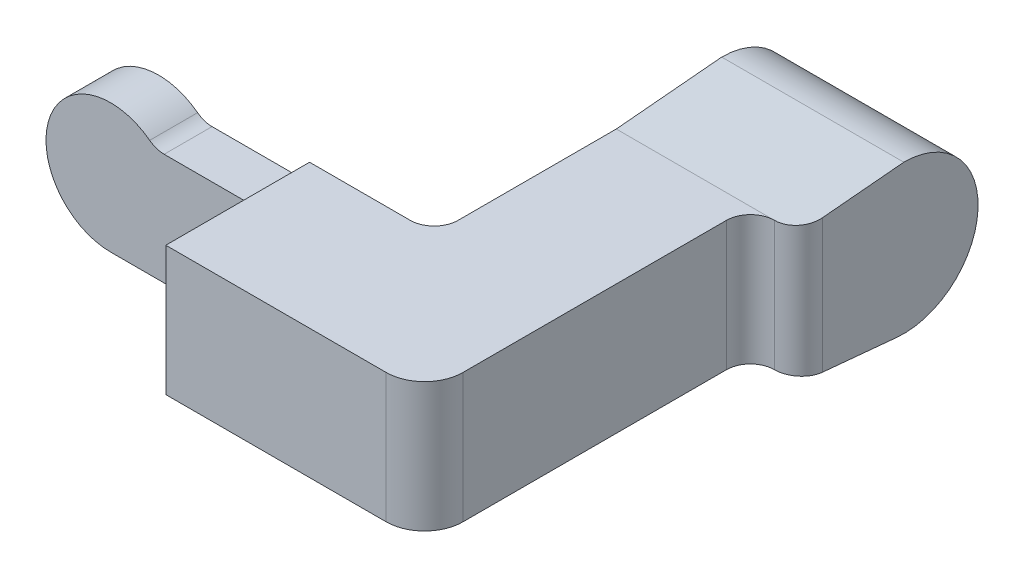
ISO-10303-21;
HEADER;
FILE_DESCRIPTION(('STEP AP214'),'2;1');
FILE_NAME('part.step','',(''),(''),'','','');
FILE_SCHEMA(('AUTOMOTIVE_DESIGN { 1 0 10303 214 1 1 1 1 }'));
ENDSEC;
DATA;
#1=APPLICATION_CONTEXT('core data for automotive mechanical design processes');
#2=APPLICATION_PROTOCOL_DEFINITION('international standard','automotive_design',2000,#1);
#3=PRODUCT_CONTEXT('',#1,'mechanical');
#4=PRODUCT('Part','Part','',(#3));
#5=PRODUCT_RELATED_PRODUCT_CATEGORY('part','',(#4));
#6=PRODUCT_DEFINITION_FORMATION('','',#4);
#7=PRODUCT_DEFINITION_CONTEXT('part definition',#1,'design');
#8=PRODUCT_DEFINITION('design','',#6,#7);
#9=PRODUCT_DEFINITION_SHAPE('','',#8);
#10=(LENGTH_UNIT() NAMED_UNIT(*) SI_UNIT(.MILLI.,.METRE.));
#11=(NAMED_UNIT(*) PLANE_ANGLE_UNIT() SI_UNIT($,.RADIAN.));
#12=(NAMED_UNIT(*) SI_UNIT($,.STERADIAN.) SOLID_ANGLE_UNIT());
#13=UNCERTAINTY_MEASURE_WITH_UNIT(LENGTH_MEASURE(1.E-05),#10,'distance_accuracy_value','');
#14=(GEOMETRIC_REPRESENTATION_CONTEXT(3) GLOBAL_UNCERTAINTY_ASSIGNED_CONTEXT((#13)) GLOBAL_UNIT_ASSIGNED_CONTEXT((#10,
#11,#12)) REPRESENTATION_CONTEXT('',''));
#15=CARTESIAN_POINT('',(0.,0.,0.));
#16=DIRECTION('',(0.,0.,1.));
#17=DIRECTION('',(1.,0.,0.));
#18=AXIS2_PLACEMENT_3D('',#15,#16,#17);
#19=CARTESIAN_POINT('',(59.,0.,-73.));
#20=DIRECTION('',(0.,-1.,0.));
#21=DIRECTION('',(0.,0.,-1.));
#22=AXIS2_PLACEMENT_3D('',#19,#20,#21);
#23=CYLINDRICAL_SURFACE('',#22,5.);
#24=DIRECTION('',(0.,1.,0.));
#25=VECTOR('',#24,1.);
#26=CARTESIAN_POINT('',(59.,-13.5,-68.));
#27=LINE('',#26,#25);
#28=CARTESIAN_POINT('',(59.,13.5,-68.));
#29=VERTEX_POINT('',#28);
#30=CARTESIAN_POINT('',(59.,-13.5,-68.));
#31=VERTEX_POINT('',#30);
#32=EDGE_CURVE('E291',#29,#31,#27,.F.);
#33=ORIENTED_EDGE('',*,*,#32,.T.);
#34=CARTESIAN_POINT('',(59.,-13.970079904175,-73.));
#35=DIRECTION('',(0.,-0.995609581526614,0.0936032113359417));
#36=DIRECTION('',(0.,-0.0936032113359417,-0.995609581526614));
#37=AXIS2_PLACEMENT_3D('',#34,#35,#36);
#38=ELLIPSE('',#37,5.02204889624834,5.);
#39=CARTESIAN_POINT('',(64.,-13.970079904175,-73.));
#40=VERTEX_POINT('',#39);
#41=EDGE_CURVE('E41',#40,#31,#38,.T.);
#42=ORIENTED_EDGE('',*,*,#41,.F.);
#43=DIRECTION('',(0.,1.,0.));
#44=VECTOR('',#43,1.);
#45=CARTESIAN_POINT('',(64.,0.,-73.));
#46=LINE('',#45,#44);
#47=CARTESIAN_POINT('',(64.,13.9545454545455,-73.));
#48=VERTEX_POINT('',#47);
#49=EDGE_CURVE('E298',#48,#40,#46,.F.);
#50=ORIENTED_EDGE('',*,*,#49,.F.);
#51=CARTESIAN_POINT('',(59.,13.9545454545455,-73.));
#52=DIRECTION('',(0.,0.995893206467704,0.0905357460425184));
#53=DIRECTION('',(0.,-0.0905357460425184,0.995893206467704));
#54=AXIS2_PLACEMENT_3D('',#51,#52,#53);
#55=ELLIPSE('',#54,5.02061864417603,5.);
#56=EDGE_CURVE('E11',#29,#48,#55,.T.);
#57=ORIENTED_EDGE('',*,*,#56,.F.);
#58=EDGE_LOOP('',(#33,#42,#50,#57));
#59=FACE_BOUND('',#58,.T.);
#60=ADVANCED_FACE('F34',(#59),#23,.T.);
#61=CARTESIAN_POINT('',(59.,-13.5,-63.));
#62=DIRECTION('',(0.,-1.,0.));
#63=DIRECTION('',(0.,0.,-1.));
#64=AXIS2_PLACEMENT_3D('',#61,#62,#63);
#65=CYLINDRICAL_SURFACE('',#64,5.);
#66=DIRECTION('',(0.,1.,0.));
#67=VECTOR('',#66,1.);
#68=CARTESIAN_POINT('',(54.,-13.5,-63.));
#69=LINE('',#68,#67);
#70=CARTESIAN_POINT('',(54.,-13.5,-63.));
#71=VERTEX_POINT('',#70);
#72=CARTESIAN_POINT('',(54.,13.5,-63.));
#73=VERTEX_POINT('',#72);
#74=EDGE_CURVE('E269',#71,#73,#69,.T.);
#75=ORIENTED_EDGE('',*,*,#74,.F.);
#76=CARTESIAN_POINT('',(59.,-13.5,-63.));
#77=DIRECTION('',(0.,1.,0.));
#78=DIRECTION('',(0.,0.,1.));
#79=AXIS2_PLACEMENT_3D('',#76,#77,#78);
#80=CIRCLE('',#79,5.);
#81=EDGE_CURVE('E293',#71,#31,#80,.F.);
#82=ORIENTED_EDGE('',*,*,#81,.T.);
#83=ORIENTED_EDGE('',*,*,#32,.F.);
#84=CARTESIAN_POINT('',(59.,13.5,-63.));
#85=DIRECTION('',(0.,1.,0.));
#86=DIRECTION('',(0.,0.,1.));
#87=AXIS2_PLACEMENT_3D('',#84,#85,#86);
#88=CIRCLE('',#87,5.);
#89=EDGE_CURVE('E296',#29,#73,#88,.T.);
#90=ORIENTED_EDGE('',*,*,#89,.T.);
#91=EDGE_LOOP('',(#75,#82,#83,#90));
#92=FACE_BOUND('',#91,.T.);
#93=ADVANCED_FACE('F313',(#92),#65,.F.);
#94=CARTESIAN_POINT('',(-2.,0.,-18.));
#95=DIRECTION('',(0.,-1.,0.));
#96=DIRECTION('',(0.,0.,-1.));
#97=AXIS2_PLACEMENT_3D('',#94,#95,#96);
#98=CYLINDRICAL_SURFACE('',#97,2.);
#99=CARTESIAN_POINT('',(-2.,11.7599365637238,-18.));
#100=DIRECTION('',(0.,0.707106781186547,-0.707106781186547));
#101=DIRECTION('',(0.,-0.707106781186547,-0.707106781186547));
#102=AXIS2_PLACEMENT_3D('',#99,#100,#101);
#103=ELLIPSE('',#102,2.82842712474619,2.);
#104=CARTESIAN_POINT('',(-2.,9.75993656372385,-20.));
#105=VERTEX_POINT('',#104);
#106=CARTESIAN_POINT('',(0.,11.7599365637238,-18.));
#107=VERTEX_POINT('',#106);
#108=EDGE_CURVE('E265',#105,#107,#103,.F.);
#109=ORIENTED_EDGE('',*,*,#108,.F.);
#110=DIRECTION('',(0.,1.,0.));
#111=VECTOR('',#110,1.);
#112=CARTESIAN_POINT('',(-2.,0.,-20.));
#113=LINE('',#112,#111);
#114=CARTESIAN_POINT('',(-2.,-13.5,-20.));
#115=VERTEX_POINT('',#114);
#116=EDGE_CURVE('E231',#115,#105,#113,.T.);
#117=ORIENTED_EDGE('',*,*,#116,.F.);
#118=CARTESIAN_POINT('',(-2.,-13.5,-18.));
#119=DIRECTION('',(0.,1.,0.));
#120=DIRECTION('',(0.,0.,1.));
#121=AXIS2_PLACEMENT_3D('',#118,#119,#120);
#122=CIRCLE('',#121,2.);
#123=CARTESIAN_POINT('',(0.,-13.5,-18.));
#124=VERTEX_POINT('',#123);
#125=EDGE_CURVE('E263',#115,#124,#122,.F.);
#126=ORIENTED_EDGE('',*,*,#125,.T.);
#127=DIRECTION('',(0.,1.,0.));
#128=VECTOR('',#127,1.);
#129=CARTESIAN_POINT('',(0.,0.,-18.));
#130=LINE('',#129,#128);
#131=EDGE_CURVE('E259',#107,#124,#130,.F.);
#132=ORIENTED_EDGE('',*,*,#131,.F.);
#133=EDGE_LOOP('',(#109,#117,#126,#132));
#134=FACE_BOUND('',#133,.T.);
#135=ADVANCED_FACE('F383',(#134),#98,.F.);
#136=CARTESIAN_POINT('',(-2.,11.7599365637238,-20.));
#137=DIRECTION('',(0.,0.,-1.));
#138=DIRECTION('',(-1.,0.,0.));
#139=AXIS2_PLACEMENT_3D('',#136,#137,#138);
#140=CYLINDRICAL_SURFACE('',#139,2.);
#141=DIRECTION('',(0.,0.,-1.));
#142=VECTOR('',#141,1.);
#143=CARTESIAN_POINT('',(-2.,9.75993656372385,-20.));
#144=LINE('',#143,#142);
#145=CARTESIAN_POINT('',(-2.,9.75993656372385,-30.));
#146=VERTEX_POINT('',#145);
#147=EDGE_CURVE('E260',#105,#146,#144,.T.);
#148=ORIENTED_EDGE('',*,*,#147,.F.);
#149=ORIENTED_EDGE('',*,*,#108,.T.);
#150=DIRECTION('',(0.,0.,-1.));
#151=VECTOR('',#150,1.);
#152=CARTESIAN_POINT('',(0.,11.7599365637238,-15.));
#153=LINE('',#152,#151);
#154=CARTESIAN_POINT('',(0.,11.7599365637238,-30.));
#155=VERTEX_POINT('',#154);
#156=EDGE_CURVE('E237',#155,#107,#153,.F.);
#157=ORIENTED_EDGE('',*,*,#156,.F.);
#158=CARTESIAN_POINT('',(-2.,11.7599365637238,-30.));
#159=DIRECTION('',(0.,0.,-1.));
#160=DIRECTION('',(-1.,0.,0.));
#161=AXIS2_PLACEMENT_3D('',#158,#159,#160);
#162=CIRCLE('',#161,2.);
#163=EDGE_CURVE('E267',#155,#146,#162,.T.);
#164=ORIENTED_EDGE('',*,*,#163,.T.);
#165=EDGE_LOOP('',(#148,#149,#157,#164));
#166=FACE_BOUND('',#165,.T.);
#167=ADVANCED_FACE('F359',(#166),#140,.F.);
#168=CARTESIAN_POINT('',(0.,-13.5,-15.));
#169=DIRECTION('',(-1.,0.,0.));
#170=DIRECTION('',(0.,0.,1.));
#171=AXIS2_PLACEMENT_3D('',#168,#169,#170);
#172=PLANE('',#171);
#173=ORIENTED_EDGE('',*,*,#156,.T.);
#174=ORIENTED_EDGE('',*,*,#131,.T.);
#175=DIRECTION('',(0.,0.,1.));
#176=VECTOR('',#175,1.);
#177=CARTESIAN_POINT('',(0.,-13.5,-15.));
#178=LINE('',#177,#176);
#179=CARTESIAN_POINT('',(0.,-13.5,0.));
#180=VERTEX_POINT('',#179);
#181=EDGE_CURVE('E223',#124,#180,#178,.T.);
#182=ORIENTED_EDGE('',*,*,#181,.T.);
#183=DIRECTION('',(0.,1.,0.));
#184=VECTOR('',#183,1.);
#185=CARTESIAN_POINT('',(0.,-13.5,0.));
#186=LINE('',#185,#184);
#187=CARTESIAN_POINT('',(0.,13.5,0.));
#188=VERTEX_POINT('',#187);
#189=EDGE_CURVE('E251',#180,#188,#186,.T.);
#190=ORIENTED_EDGE('',*,*,#189,.T.);
#191=DIRECTION('',(0.,0.,1.));
#192=VECTOR('',#191,1.);
#193=CARTESIAN_POINT('',(0.,13.5,-15.));
#194=LINE('',#193,#192);
#195=CARTESIAN_POINT('',(0.,13.5,-30.));
#196=VERTEX_POINT('',#195);
#197=EDGE_CURVE('E203',#196,#188,#194,.T.);
#198=ORIENTED_EDGE('',*,*,#197,.F.);
#199=DIRECTION('',(0.,1.,0.));
#200=VECTOR('',#199,1.);
#201=CARTESIAN_POINT('',(0.,-13.5,-30.));
#202=LINE('',#201,#200);
#203=EDGE_CURVE('E233',#155,#196,#202,.T.);
#204=ORIENTED_EDGE('',*,*,#203,.F.);
#205=EDGE_LOOP('',(#173,#174,#182,#190,#198,#204));
#206=FACE_BOUND('',#205,.T.);
#207=ADVANCED_FACE('F366',(#206),#172,.T.);
#208=CARTESIAN_POINT('',(21.,-13.5,-30.));
#209=DIRECTION('',(0.,0.,-1.));
#210=DIRECTION('',(-1.,0.,0.));
#211=AXIS2_PLACEMENT_3D('',#208,#209,#210);
#212=PLANE('',#211);
#213=ORIENTED_EDGE('',*,*,#163,.F.);
#214=ORIENTED_EDGE('',*,*,#203,.T.);
#215=DIRECTION('',(-1.,0.,0.));
#216=VECTOR('',#215,1.);
#217=CARTESIAN_POINT('',(21.,13.5,-30.));
#218=LINE('',#217,#216);
#219=CARTESIAN_POINT('',(21.,13.5,-30.));
#220=VERTEX_POINT('',#219);
#221=EDGE_CURVE('E220',#220,#196,#218,.T.);
#222=ORIENTED_EDGE('',*,*,#221,.F.);
#223=DIRECTION('',(0.,1.,0.));
#224=VECTOR('',#223,1.);
#225=CARTESIAN_POINT('',(21.,-13.5,-30.));
#226=LINE('',#225,#224);
#227=CARTESIAN_POINT('',(21.,-13.5,-30.));
#228=VERTEX_POINT('',#227);
#229=EDGE_CURVE('E236',#228,#220,#226,.T.);
#230=ORIENTED_EDGE('',*,*,#229,.F.);
#231=DIRECTION('',(-1.,0.,0.));
#232=VECTOR('',#231,1.);
#233=CARTESIAN_POINT('',(21.,-13.5,-30.));
#234=LINE('',#233,#232);
#235=CARTESIAN_POINT('',(-31.5,-13.5,-30.));
#236=VERTEX_POINT('',#235);
#237=EDGE_CURVE('E242',#228,#236,#234,.T.);
#238=ORIENTED_EDGE('',*,*,#237,.T.);
#239=CARTESIAN_POINT('',(-31.5,0.,-30.));
#240=DIRECTION('',(0.,0.,1.));
#241=DIRECTION('',(1.,0.,0.));
#242=AXIS2_PLACEMENT_3D('',#239,#240,#241);
#243=CIRCLE('',#242,13.5);
#244=CARTESIAN_POINT('',(-23.3611652144772,10.7707645194742,-30.));
#245=VERTEX_POINT('',#244);
#246=EDGE_CURVE('E185',#245,#236,#243,.T.);
#247=ORIENTED_EDGE('',*,*,#246,.F.);
#248=CARTESIAN_POINT('',(-20.3467819605798,14.7599365637238,-30.));
#249=DIRECTION('',(0.,0.,-1.));
#250=DIRECTION('',(-1.,0.,0.));
#251=AXIS2_PLACEMENT_3D('',#248,#249,#250);
#252=CIRCLE('',#251,5.);
#253=CARTESIAN_POINT('',(-20.3467819605798,9.75993656372384,-30.));
#254=VERTEX_POINT('',#253);
#255=EDGE_CURVE('E190',#254,#245,#252,.T.);
#256=ORIENTED_EDGE('',*,*,#255,.F.);
#257=DIRECTION('',(-1.,0.,0.));
#258=VECTOR('',#257,1.);
#259=CARTESIAN_POINT('',(0.,9.75993656372385,-30.));
#260=LINE('',#259,#258);
#261=EDGE_CURVE('E180',#146,#254,#260,.T.);
#262=ORIENTED_EDGE('',*,*,#261,.F.);
#263=EDGE_LOOP('',(#213,#214,#222,#230,#238,#247,#256,#262));
#264=FACE_BOUND('',#263,.T.);
#265=ADVANCED_FACE('F335',(#264),#212,.T.);
#266=CARTESIAN_POINT('',(21.,-13.5,-35.));
#267=DIRECTION('',(0.,1.,0.));
#268=DIRECTION('',(0.,0.,1.));
#269=AXIS2_PLACEMENT_3D('',#266,#267,#268);
#270=CYLINDRICAL_SURFACE('',#269,5.);
#271=ORIENTED_EDGE('',*,*,#229,.T.);
#272=CARTESIAN_POINT('',(21.,13.5,-35.));
#273=DIRECTION('',(0.,-1.,0.));
#274=DIRECTION('',(0.,0.,1.));
#275=AXIS2_PLACEMENT_3D('',#272,#273,#274);
#276=CIRCLE('',#275,5.);
#277=CARTESIAN_POINT('',(26.,13.5,-35.));
#278=VERTEX_POINT('',#277);
#279=EDGE_CURVE('E216',#278,#220,#276,.T.);
#280=ORIENTED_EDGE('',*,*,#279,.F.);
#281=DIRECTION('',(0.,1.,0.));
#282=VECTOR('',#281,1.);
#283=CARTESIAN_POINT('',(26.,-13.5,-35.));
#284=LINE('',#283,#282);
#285=CARTESIAN_POINT('',(26.,-13.5,-35.));
#286=VERTEX_POINT('',#285);
#287=EDGE_CURVE('E245',#286,#278,#284,.T.);
#288=ORIENTED_EDGE('',*,*,#287,.F.);
#289=CARTESIAN_POINT('',(21.,-13.5,-35.));
#290=DIRECTION('',(0.,-1.,0.));
#291=DIRECTION('',(0.,0.,1.));
#292=AXIS2_PLACEMENT_3D('',#289,#290,#291);
#293=CIRCLE('',#292,5.);
#294=EDGE_CURVE('E329',#286,#228,#293,.T.);
#295=ORIENTED_EDGE('',*,*,#294,.T.);
#296=EDGE_LOOP('',(#271,#280,#288,#295));
#297=FACE_BOUND('',#296,.T.);
#298=ADVANCED_FACE('F368',(#297),#270,.F.);
#299=CARTESIAN_POINT('',(26.,-13.5,-68.));
#300=DIRECTION('',(-1.,0.,0.));
#301=DIRECTION('',(0.,0.,1.));
#302=AXIS2_PLACEMENT_3D('',#299,#300,#301);
#303=PLANE('',#302);
#304=ORIENTED_EDGE('',*,*,#287,.T.);
#305=DIRECTION('',(0.,0.,1.));
#306=VECTOR('',#305,1.);
#307=CARTESIAN_POINT('',(26.,13.5,-68.));
#308=LINE('',#307,#306);
#309=CARTESIAN_POINT('',(26.,13.5,-68.));
#310=VERTEX_POINT('',#309);
#311=EDGE_CURVE('E213',#310,#278,#308,.T.);
#312=ORIENTED_EDGE('',*,*,#311,.F.);
#313=DIRECTION('',(0.,0.0905357460425184,-0.995893206467704));
#314=VECTOR('',#313,1.);
#315=CARTESIAN_POINT('',(26.,7.25819672131148,0.659836065573768));
#316=LINE('',#315,#314);
#317=CARTESIAN_POINT('',(26.,15.5,-90.));
#318=VERTEX_POINT('',#317);
#319=EDGE_CURVE('E175',#310,#318,#316,.T.);
#320=ORIENTED_EDGE('',*,*,#319,.T.);
#321=CARTESIAN_POINT('',(26.,0.,-90.));
#322=DIRECTION('',(-1.,0.,0.));
#323=DIRECTION('',(0.,0.,1.));
#324=AXIS2_PLACEMENT_3D('',#321,#322,#323);
#325=CIRCLE('',#324,15.5);
#326=CARTESIAN_POINT('',(26.,-15.4319485136625,-88.5491502242929));
#327=VERTEX_POINT('',#326);
#328=EDGE_CURVE('E164',#318,#327,#325,.T.);
#329=ORIENTED_EDGE('',*,*,#328,.T.);
#330=DIRECTION('',(0.,0.0936032113359417,0.995609581526614));
#331=VECTOR('',#330,1.);
#332=CARTESIAN_POINT('',(26.,-7.04464564756735,0.662309270191007));
#333=LINE('',#332,#331);
#334=CARTESIAN_POINT('',(26.,-13.5,-68.));
#335=VERTEX_POINT('',#334);
#336=EDGE_CURVE('E158',#327,#335,#333,.T.);
#337=ORIENTED_EDGE('',*,*,#336,.T.);
#338=DIRECTION('',(0.,0.,1.));
#339=VECTOR('',#338,1.);
#340=CARTESIAN_POINT('',(26.,-13.5,-68.));
#341=LINE('',#340,#339);
#342=EDGE_CURVE('E280',#335,#286,#341,.T.);
#343=ORIENTED_EDGE('',*,*,#342,.T.);
#344=EDGE_LOOP('',(#304,#312,#320,#329,#337,#343));
#345=FACE_BOUND('',#344,.T.);
#346=ADVANCED_FACE('F370',(#345),#303,.T.);
#347=CARTESIAN_POINT('',(54.,-13.5,-8.00000000000006));
#348=DIRECTION('',(1.,0.,0.));
#349=DIRECTION('',(0.,0.,-1.));
#350=AXIS2_PLACEMENT_3D('',#347,#348,#349);
#351=PLANE('',#350);
#352=DIRECTION('',(0.,0.,-1.));
#353=VECTOR('',#352,1.);
#354=CARTESIAN_POINT('',(54.,-13.5,-8.00000000000006));
#355=LINE('',#354,#353);
#356=CARTESIAN_POINT('',(54.,-13.5,-8.00000000000005));
#357=VERTEX_POINT('',#356);
#358=EDGE_CURVE('E281',#357,#71,#355,.T.);
#359=ORIENTED_EDGE('',*,*,#358,.T.);
#360=ORIENTED_EDGE('',*,*,#74,.T.);
#361=DIRECTION('',(0.,0.,-1.));
#362=VECTOR('',#361,1.);
#363=CARTESIAN_POINT('',(54.,13.5,-8.00000000000006));
#364=LINE('',#363,#362);
#365=CARTESIAN_POINT('',(54.,13.5,-8.00000000000005));
#366=VERTEX_POINT('',#365);
#367=EDGE_CURVE('E212',#366,#73,#364,.T.);
#368=ORIENTED_EDGE('',*,*,#367,.F.);
#369=DIRECTION('',(0.,1.,0.));
#370=VECTOR('',#369,1.);
#371=CARTESIAN_POINT('',(54.,-13.5,-8.00000000000005));
#372=LINE('',#371,#370);
#373=EDGE_CURVE('E247',#357,#366,#372,.T.);
#374=ORIENTED_EDGE('',*,*,#373,.F.);
#375=EDGE_LOOP('',(#359,#360,#368,#374));
#376=FACE_BOUND('',#375,.T.);
#377=ADVANCED_FACE('F320',(#376),#351,.T.);
#378=CARTESIAN_POINT('',(46.,-13.5,-8.));
#379=DIRECTION('',(0.,1.,0.));
#380=DIRECTION('',(0.,0.,1.));
#381=AXIS2_PLACEMENT_3D('',#378,#379,#380);
#382=CYLINDRICAL_SURFACE('',#381,8.);
#383=ORIENTED_EDGE('',*,*,#373,.T.);
#384=CARTESIAN_POINT('',(46.,13.5,-8.));
#385=DIRECTION('',(0.,1.,0.));
#386=DIRECTION('',(0.,0.,1.));
#387=AXIS2_PLACEMENT_3D('',#384,#385,#386);
#388=CIRCLE('',#387,8.);
#389=CARTESIAN_POINT('',(45.9999999999999,13.5,0.));
#390=VERTEX_POINT('',#389);
#391=EDGE_CURVE('E209',#390,#366,#388,.T.);
#392=ORIENTED_EDGE('',*,*,#391,.F.);
#393=DIRECTION('',(0.,1.,0.));
#394=VECTOR('',#393,1.);
#395=CARTESIAN_POINT('',(45.9999999999999,-13.5,0.));
#396=LINE('',#395,#394);
#397=CARTESIAN_POINT('',(45.9999999999999,-13.5,0.));
#398=VERTEX_POINT('',#397);
#399=EDGE_CURVE('E249',#398,#390,#396,.T.);
#400=ORIENTED_EDGE('',*,*,#399,.F.);
#401=CARTESIAN_POINT('',(46.,-13.5,-8.));
#402=DIRECTION('',(0.,1.,0.));
#403=DIRECTION('',(0.,0.,1.));
#404=AXIS2_PLACEMENT_3D('',#401,#402,#403);
#405=CIRCLE('',#404,8.);
#406=EDGE_CURVE('E286',#398,#357,#405,.T.);
#407=ORIENTED_EDGE('',*,*,#406,.T.);
#408=EDGE_LOOP('',(#383,#392,#400,#407));
#409=FACE_BOUND('',#408,.T.);
#410=ADVANCED_FACE('F326',(#409),#382,.T.);
#411=CARTESIAN_POINT('',(0.,-13.5,0.));
#412=DIRECTION('',(0.,0.,1.));
#413=DIRECTION('',(1.,0.,0.));
#414=AXIS2_PLACEMENT_3D('',#411,#412,#413);
#415=PLANE('',#414);
#416=ORIENTED_EDGE('',*,*,#399,.T.);
#417=DIRECTION('',(1.,0.,0.));
#418=VECTOR('',#417,1.);
#419=CARTESIAN_POINT('',(0.,13.5,0.));
#420=LINE('',#419,#418);
#421=EDGE_CURVE('E206',#188,#390,#420,.T.);
#422=ORIENTED_EDGE('',*,*,#421,.F.);
#423=ORIENTED_EDGE('',*,*,#189,.F.);
#424=DIRECTION('',(1.,0.,0.));
#425=VECTOR('',#424,1.);
#426=CARTESIAN_POINT('',(0.,-13.5,0.));
#427=LINE('',#426,#425);
#428=EDGE_CURVE('E226',#180,#398,#427,.T.);
#429=ORIENTED_EDGE('',*,*,#428,.T.);
#430=EDGE_LOOP('',(#416,#422,#423,#429));
#431=FACE_BOUND('',#430,.T.);
#432=ADVANCED_FACE('F392',(#431),#415,.T.);
#433=CARTESIAN_POINT('',(46.,-13.5,-8.));
#434=DIRECTION('',(0.,1.,0.));
#435=DIRECTION('',(0.,0.,1.));
#436=AXIS2_PLACEMENT_3D('',#433,#434,#435);
#437=PLANE('',#436);
#438=ORIENTED_EDGE('',*,*,#181,.F.);
#439=ORIENTED_EDGE('',*,*,#125,.F.);
#440=DIRECTION('',(1.,0.,0.));
#441=VECTOR('',#440,1.);
#442=CARTESIAN_POINT('',(0.,-13.5,-20.));
#443=LINE('',#442,#441);
#444=CARTESIAN_POINT('',(-31.5,-13.5,-20.));
#445=VERTEX_POINT('',#444);
#446=EDGE_CURVE('E189',#445,#115,#443,.T.);
#447=ORIENTED_EDGE('',*,*,#446,.F.);
#448=DIRECTION('',(0.,0.,-1.));
#449=VECTOR('',#448,1.);
#450=CARTESIAN_POINT('',(-31.5,-13.5,-20.));
#451=LINE('',#450,#449);
#452=EDGE_CURVE('E194',#445,#236,#451,.T.);
#453=ORIENTED_EDGE('',*,*,#452,.T.);
#454=ORIENTED_EDGE('',*,*,#237,.F.);
#455=ORIENTED_EDGE('',*,*,#294,.F.);
#456=ORIENTED_EDGE('',*,*,#342,.F.);
#457=DIRECTION('',(-1.,0.,0.));
#458=VECTOR('',#457,1.);
#459=CARTESIAN_POINT('',(54.,-13.5,-68.));
#460=LINE('',#459,#458);
#461=EDGE_CURVE('E278',#31,#335,#460,.T.);
#462=ORIENTED_EDGE('',*,*,#461,.F.);
#463=ORIENTED_EDGE('',*,*,#81,.F.);
#464=ORIENTED_EDGE('',*,*,#358,.F.);
#465=ORIENTED_EDGE('',*,*,#406,.F.);
#466=ORIENTED_EDGE('',*,*,#428,.F.);
#467=EDGE_LOOP('',(#438,#439,#447,#453,#454,#455,#456,#462,#463,#464,#465,#466));
#468=FACE_BOUND('',#467,.T.);
#469=ADVANCED_FACE('F306',(#468),#437,.F.);
#470=CARTESIAN_POINT('',(46.,13.5,-8.));
#471=DIRECTION('',(0.,1.,0.));
#472=DIRECTION('',(0.,0.,1.));
#473=AXIS2_PLACEMENT_3D('',#470,#471,#472);
#474=PLANE('',#473);
#475=ORIENTED_EDGE('',*,*,#197,.T.);
#476=ORIENTED_EDGE('',*,*,#421,.T.);
#477=ORIENTED_EDGE('',*,*,#391,.T.);
#478=ORIENTED_EDGE('',*,*,#367,.T.);
#479=ORIENTED_EDGE('',*,*,#89,.F.);
#480=DIRECTION('',(-1.,0.,0.));
#481=VECTOR('',#480,1.);
#482=CARTESIAN_POINT('',(54.,13.5,-68.));
#483=LINE('',#482,#481);
#484=EDGE_CURVE('E217',#29,#310,#483,.T.);
#485=ORIENTED_EDGE('',*,*,#484,.T.);
#486=ORIENTED_EDGE('',*,*,#311,.T.);
#487=ORIENTED_EDGE('',*,*,#279,.T.);
#488=ORIENTED_EDGE('',*,*,#221,.T.);
#489=EDGE_LOOP('',(#475,#476,#477,#478,#479,#485,#486,#487,#488));
#490=FACE_BOUND('',#489,.T.);
#491=ADVANCED_FACE('F317',(#490),#474,.T.);
#492=CARTESIAN_POINT('',(0.,9.75993656372385,-20.));
#493=DIRECTION('',(0.,-1.,0.));
#494=DIRECTION('',(1.,0.,0.));
#495=AXIS2_PLACEMENT_3D('',#492,#493,#494);
#496=PLANE('',#495);
#497=DIRECTION('',(-1.,0.,0.));
#498=VECTOR('',#497,1.);
#499=CARTESIAN_POINT('',(0.,9.75993656372385,-20.));
#500=LINE('',#499,#498);
#501=CARTESIAN_POINT('',(-20.3467819605798,9.75993656372384,-20.));
#502=VERTEX_POINT('',#501);
#503=EDGE_CURVE('E182',#105,#502,#500,.T.);
#504=ORIENTED_EDGE('',*,*,#503,.F.);
#505=ORIENTED_EDGE('',*,*,#147,.T.);
#506=ORIENTED_EDGE('',*,*,#261,.T.);
#507=DIRECTION('',(0.,0.,-1.));
#508=VECTOR('',#507,1.);
#509=CARTESIAN_POINT('',(-20.3467819605798,9.75993656372384,-20.));
#510=LINE('',#509,#508);
#511=EDGE_CURVE('E200',#502,#254,#510,.T.);
#512=ORIENTED_EDGE('',*,*,#511,.F.);
#513=EDGE_LOOP('',(#504,#505,#506,#512));
#514=FACE_BOUND('',#513,.T.);
#515=ADVANCED_FACE('F356',(#514),#496,.F.);
#516=CARTESIAN_POINT('',(-20.3467819605798,14.7599365637238,-20.));
#517=DIRECTION('',(0.,0.,-1.));
#518=DIRECTION('',(-1.,0.,0.));
#519=AXIS2_PLACEMENT_3D('',#516,#517,#518);
#520=CYLINDRICAL_SURFACE('',#519,5.);
#521=ORIENTED_EDGE('',*,*,#255,.T.);
#522=DIRECTION('',(0.,0.,-1.));
#523=VECTOR('',#522,1.);
#524=CARTESIAN_POINT('',(-23.3611652144772,10.7707645194742,-20.));
#525=LINE('',#524,#523);
#526=CARTESIAN_POINT('',(-23.3611652144772,10.7707645194742,-20.));
#527=VERTEX_POINT('',#526);
#528=EDGE_CURVE('E197',#527,#245,#525,.T.);
#529=ORIENTED_EDGE('',*,*,#528,.F.);
#530=CARTESIAN_POINT('',(-20.3467819605798,14.7599365637238,-20.));
#531=DIRECTION('',(0.,0.,-1.));
#532=DIRECTION('',(-1.,0.,0.));
#533=AXIS2_PLACEMENT_3D('',#530,#531,#532);
#534=CIRCLE('',#533,5.);
#535=EDGE_CURVE('E184',#502,#527,#534,.T.);
#536=ORIENTED_EDGE('',*,*,#535,.F.);
#537=ORIENTED_EDGE('',*,*,#511,.T.);
#538=EDGE_LOOP('',(#521,#529,#536,#537));
#539=FACE_BOUND('',#538,.T.);
#540=ADVANCED_FACE('F352',(#539),#520,.F.);
#541=CARTESIAN_POINT('',(-31.5,0.,-20.));
#542=DIRECTION('',(0.,0.,-1.));
#543=DIRECTION('',(-1.,0.,0.));
#544=AXIS2_PLACEMENT_3D('',#541,#542,#543);
#545=CYLINDRICAL_SURFACE('',#544,13.5);
#546=ORIENTED_EDGE('',*,*,#246,.T.);
#547=ORIENTED_EDGE('',*,*,#452,.F.);
#548=CARTESIAN_POINT('',(-31.5,0.,-20.));
#549=DIRECTION('',(0.,0.,1.));
#550=DIRECTION('',(1.,0.,0.));
#551=AXIS2_PLACEMENT_3D('',#548,#549,#550);
#552=CIRCLE('',#551,13.5);
#553=EDGE_CURVE('E187',#527,#445,#552,.T.);
#554=ORIENTED_EDGE('',*,*,#553,.F.);
#555=ORIENTED_EDGE('',*,*,#528,.T.);
#556=EDGE_LOOP('',(#546,#547,#554,#555));
#557=FACE_BOUND('',#556,.T.);
#558=ADVANCED_FACE('F340',(#557),#545,.T.);
#559=CARTESIAN_POINT('',(-31.5,0.,-20.));
#560=DIRECTION('',(0.,0.,1.));
#561=DIRECTION('',(1.,0.,0.));
#562=AXIS2_PLACEMENT_3D('',#559,#560,#561);
#563=PLANE('',#562);
#564=ORIENTED_EDGE('',*,*,#446,.T.);
#565=ORIENTED_EDGE('',*,*,#116,.T.);
#566=ORIENTED_EDGE('',*,*,#503,.T.);
#567=ORIENTED_EDGE('',*,*,#535,.T.);
#568=ORIENTED_EDGE('',*,*,#553,.T.);
#569=EDGE_LOOP('',(#564,#565,#566,#567,#568));
#570=FACE_BOUND('',#569,.T.);
#571=ADVANCED_FACE('F347',(#570),#563,.T.);
#572=CARTESIAN_POINT('',(64.,7.25819672131148,0.659836065573764));
#573=DIRECTION('',(0.,0.995893206467704,0.0905357460425184));
#574=DIRECTION('',(0.,-0.0905357460425184,0.995893206467704));
#575=AXIS2_PLACEMENT_3D('',#572,#573,#574);
#576=PLANE('',#575);
#577=ORIENTED_EDGE('',*,*,#484,.F.);
#578=ORIENTED_EDGE('',*,*,#56,.T.);
#579=DIRECTION('',(0.,0.0905357460425184,-0.995893206467704));
#580=VECTOR('',#579,1.);
#581=CARTESIAN_POINT('',(64.,7.25819672131148,0.659836065573764));
#582=LINE('',#581,#580);
#583=CARTESIAN_POINT('',(64.,15.5,-90.));
#584=VERTEX_POINT('',#583);
#585=EDGE_CURVE('E150',#48,#584,#582,.T.);
#586=ORIENTED_EDGE('',*,*,#585,.T.);
#587=DIRECTION('',(-1.,0.,0.));
#588=VECTOR('',#587,1.);
#589=CARTESIAN_POINT('',(64.,15.5,-90.));
#590=LINE('',#589,#588);
#591=EDGE_CURVE('E153',#584,#318,#590,.T.);
#592=ORIENTED_EDGE('',*,*,#591,.T.);
#593=ORIENTED_EDGE('',*,*,#319,.F.);
#594=EDGE_LOOP('',(#577,#578,#586,#592,#593));
#595=FACE_BOUND('',#594,.T.);
#596=ADVANCED_FACE('F152',(#595),#576,.T.);
#597=CARTESIAN_POINT('',(64.,-7.04464564756735,0.662309270191003));
#598=DIRECTION('',(0.,-0.995609581526614,0.0936032113359417));
#599=DIRECTION('',(0.,-0.0936032113359417,-0.995609581526614));
#600=AXIS2_PLACEMENT_3D('',#597,#598,#599);
#601=PLANE('',#600);
#602=DIRECTION('',(0.,0.0936032113359417,0.995609581526614));
#603=VECTOR('',#602,1.);
#604=CARTESIAN_POINT('',(64.,-7.04464564756735,0.662309270191003));
#605=LINE('',#604,#603);
#606=CARTESIAN_POINT('',(64.,-15.4319485136625,-88.5491502242929));
#607=VERTEX_POINT('',#606);
#608=EDGE_CURVE('E167',#607,#40,#605,.T.);
#609=ORIENTED_EDGE('',*,*,#608,.T.);
#610=ORIENTED_EDGE('',*,*,#41,.T.);
#611=ORIENTED_EDGE('',*,*,#461,.T.);
#612=ORIENTED_EDGE('',*,*,#336,.F.);
#613=DIRECTION('',(-1.,0.,0.));
#614=VECTOR('',#613,1.);
#615=CARTESIAN_POINT('',(64.,-15.4319485136625,-88.5491502242929));
#616=LINE('',#615,#614);
#617=EDGE_CURVE('E166',#607,#327,#616,.T.);
#618=ORIENTED_EDGE('',*,*,#617,.F.);
#619=EDGE_LOOP('',(#609,#610,#611,#612,#618));
#620=FACE_BOUND('',#619,.T.);
#621=ADVANCED_FACE('F301',(#620),#601,.T.);
#622=CARTESIAN_POINT('',(64.,0.,-90.));
#623=DIRECTION('',(-1.,0.,0.));
#624=DIRECTION('',(0.,0.,1.));
#625=AXIS2_PLACEMENT_3D('',#622,#623,#624);
#626=CYLINDRICAL_SURFACE('',#625,15.5);
#627=ORIENTED_EDGE('',*,*,#328,.F.);
#628=ORIENTED_EDGE('',*,*,#591,.F.);
#629=CARTESIAN_POINT('',(64.,0.,-90.));
#630=DIRECTION('',(-1.,0.,0.));
#631=DIRECTION('',(0.,0.,1.));
#632=AXIS2_PLACEMENT_3D('',#629,#630,#631);
#633=CIRCLE('',#632,15.5);
#634=EDGE_CURVE('E157',#584,#607,#633,.T.);
#635=ORIENTED_EDGE('',*,*,#634,.T.);
#636=ORIENTED_EDGE('',*,*,#617,.T.);
#637=EDGE_LOOP('',(#627,#628,#635,#636));
#638=FACE_BOUND('',#637,.T.);
#639=ADVANCED_FACE('F162',(#638),#626,.T.);
#640=CARTESIAN_POINT('',(64.,0.,0.));
#641=DIRECTION('',(-1.,0.,0.));
#642=DIRECTION('',(0.,0.,1.));
#643=AXIS2_PLACEMENT_3D('',#640,#641,#642);
#644=PLANE('',#643);
#645=ORIENTED_EDGE('',*,*,#585,.F.);
#646=ORIENTED_EDGE('',*,*,#49,.T.);
#647=ORIENTED_EDGE('',*,*,#608,.F.);
#648=ORIENTED_EDGE('',*,*,#634,.F.);
#649=EDGE_LOOP('',(#645,#646,#647,#648));
#650=FACE_BOUND('',#649,.T.);
#651=ADVANCED_FACE('F170',(#650),#644,.F.);
#652=CLOSED_SHELL('',(#60,#93,#135,#167,#207,#265,#298,#346,#377,#410,#432,#469,#491,#515,#540,
#558,#571,#596,#621,#639,#651));
#653=MANIFOLD_SOLID_BREP('B2',#652);
#654=ADVANCED_BREP_SHAPE_REPRESENTATION('',(#18,#653),#14);
#655=SHAPE_DEFINITION_REPRESENTATION(#9,#654);
ENDSEC;
END-ISO-10303-21;
